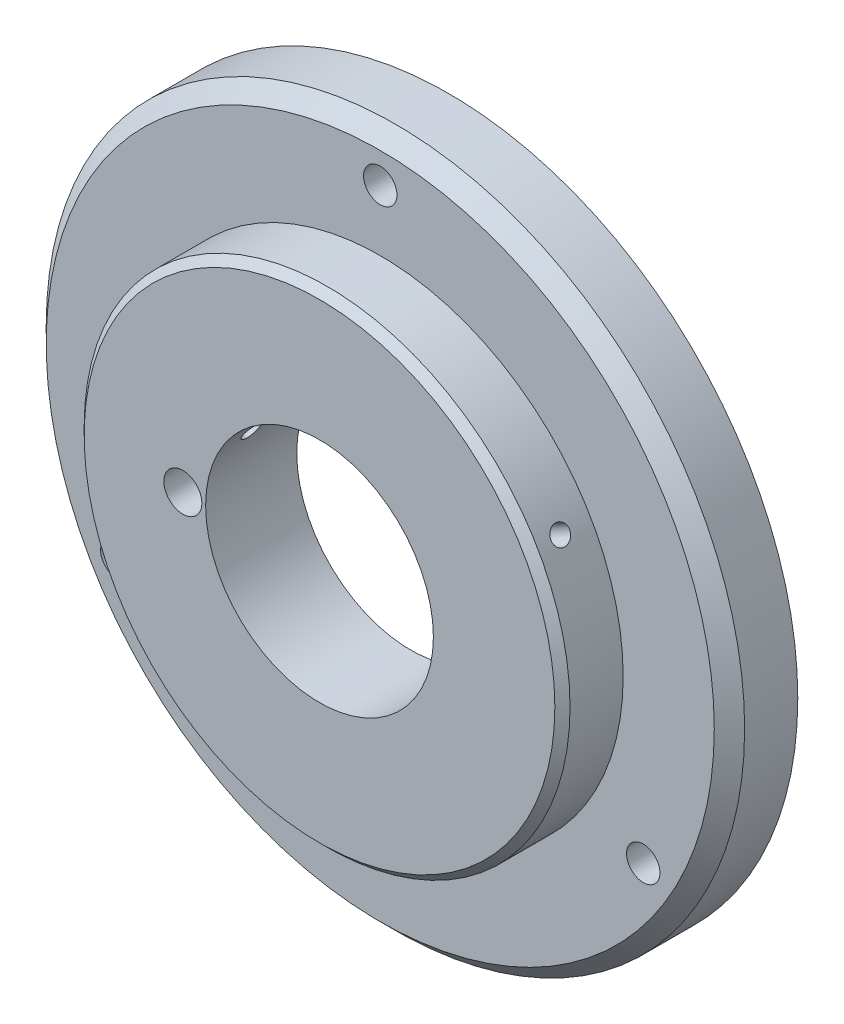
ISO-10303-21;
HEADER;
FILE_DESCRIPTION(('STEP AP214'),'2;1');
FILE_NAME('part.step','',(''),(''),'','','');
FILE_SCHEMA(('AUTOMOTIVE_DESIGN { 1 0 10303 214 1 1 1 1 }'));
ENDSEC;
DATA;
#1=APPLICATION_CONTEXT('core data for automotive mechanical design processes');
#2=APPLICATION_PROTOCOL_DEFINITION('international standard','automotive_design',2000,#1);
#3=PRODUCT_CONTEXT('',#1,'mechanical');
#4=PRODUCT('Part','Part','',(#3));
#5=PRODUCT_RELATED_PRODUCT_CATEGORY('part','',(#4));
#6=PRODUCT_DEFINITION_FORMATION('','',#4);
#7=PRODUCT_DEFINITION_CONTEXT('part definition',#1,'design');
#8=PRODUCT_DEFINITION('design','',#6,#7);
#9=PRODUCT_DEFINITION_SHAPE('','',#8);
#10=(LENGTH_UNIT() NAMED_UNIT(*) SI_UNIT(.MILLI.,.METRE.));
#11=(NAMED_UNIT(*) PLANE_ANGLE_UNIT() SI_UNIT($,.RADIAN.));
#12=(NAMED_UNIT(*) SI_UNIT($,.STERADIAN.) SOLID_ANGLE_UNIT());
#13=UNCERTAINTY_MEASURE_WITH_UNIT(LENGTH_MEASURE(1.E-05),#10,'distance_accuracy_value','');
#14=(GEOMETRIC_REPRESENTATION_CONTEXT(3) GLOBAL_UNCERTAINTY_ASSIGNED_CONTEXT((#13)) GLOBAL_UNIT_ASSIGNED_CONTEXT((#10,
#11,#12)) REPRESENTATION_CONTEXT('',''));
#15=CARTESIAN_POINT('',(0.,0.,0.));
#16=DIRECTION('',(0.,0.,1.));
#17=DIRECTION('',(1.,0.,0.));
#18=AXIS2_PLACEMENT_3D('',#15,#16,#17);
#19=CARTESIAN_POINT('',(0.,0.,9.));
#20=DIRECTION('',(0.,0.,1.));
#21=DIRECTION('',(1.,0.,0.));
#22=AXIS2_PLACEMENT_3D('',#19,#20,#21);
#23=PLANE('',#22);
#24=CARTESIAN_POINT('',(0.,0.,9.));
#25=DIRECTION('',(0.,0.,1.));
#26=DIRECTION('',(1.,0.,0.));
#27=AXIS2_PLACEMENT_3D('',#24,#25,#26);
#28=CIRCLE('',#27,44.);
#29=CARTESIAN_POINT('',(44.,0.,9.));
#30=VERTEX_POINT('',#29);
#31=EDGE_CURVE('E49',#30,#30,#28,.T.);
#32=ORIENTED_EDGE('',*,*,#31,.T.);
#33=EDGE_LOOP('',(#32));
#34=FACE_BOUND('',#33,.T.);
#35=CARTESIAN_POINT('',(-34.6410161513777,-19.9999999999997,9.));
#36=DIRECTION('',(0.,0.,1.));
#37=DIRECTION('',(-0.499999999999992,0.866025403784443,0.));
#38=AXIS2_PLACEMENT_3D('',#35,#36,#37);
#39=CIRCLE('',#38,2.2);
#40=CARTESIAN_POINT('',(-35.7410161513777,-18.0947441116739,9.));
#41=VERTEX_POINT('',#40);
#42=EDGE_CURVE('E83',#41,#41,#39,.T.);
#43=ORIENTED_EDGE('',*,*,#42,.F.);
#44=EDGE_LOOP('',(#43));
#45=FACE_BOUND('',#44,.T.);
#46=CARTESIAN_POINT('',(34.6410161513775,-20.0000000000002,9.));
#47=DIRECTION('',(0.,0.,1.));
#48=DIRECTION('',(-0.500000000000004,-0.866025403784436,0.));
#49=AXIS2_PLACEMENT_3D('',#46,#47,#48);
#50=CIRCLE('',#49,2.2);
#51=CARTESIAN_POINT('',(33.5410161513775,-21.9052558883259,9.));
#52=VERTEX_POINT('',#51);
#53=EDGE_CURVE('E77',#52,#52,#50,.T.);
#54=ORIENTED_EDGE('',*,*,#53,.F.);
#55=EDGE_LOOP('',(#54));
#56=FACE_BOUND('',#55,.T.);
#57=CARTESIAN_POINT('',(0.,40.,9.));
#58=DIRECTION('',(0.,0.,1.));
#59=DIRECTION('',(1.,0.,0.));
#60=AXIS2_PLACEMENT_3D('',#57,#58,#59);
#61=CIRCLE('',#60,2.2);
#62=CARTESIAN_POINT('',(2.2,40.,9.));
#63=VERTEX_POINT('',#62);
#64=EDGE_CURVE('E71',#63,#63,#61,.T.);
#65=ORIENTED_EDGE('',*,*,#64,.F.);
#66=EDGE_LOOP('',(#65));
#67=FACE_BOUND('',#66,.T.);
#68=CARTESIAN_POINT('',(0.,0.,9.));
#69=DIRECTION('',(0.,0.,1.));
#70=DIRECTION('',(1.,0.,0.));
#71=AXIS2_PLACEMENT_3D('',#68,#69,#70);
#72=CIRCLE('',#71,32.);
#73=CARTESIAN_POINT('',(32.,0.,9.));
#74=VERTEX_POINT('',#73);
#75=EDGE_CURVE('E55',#74,#74,#72,.T.);
#76=ORIENTED_EDGE('',*,*,#75,.F.);
#77=EDGE_LOOP('',(#76));
#78=FACE_BOUND('',#77,.T.);
#79=ADVANCED_FACE('F32',(#34,#45,#56,#67,#78),#23,.T.);
#80=CARTESIAN_POINT('',(0.,0.,9.));
#81=DIRECTION('',(0.,0.,-1.));
#82=DIRECTION('',(-1.,0.,0.));
#83=AXIS2_PLACEMENT_3D('',#80,#81,#82);
#84=CYLINDRICAL_SURFACE('',#83,46.);
#85=CARTESIAN_POINT('',(0.,0.,7.));
#86=DIRECTION('',(0.,0.,1.));
#87=DIRECTION('',(1.,0.,0.));
#88=AXIS2_PLACEMENT_3D('',#85,#86,#87);
#89=CIRCLE('',#88,46.);
#90=CARTESIAN_POINT('',(46.,0.,7.));
#91=VERTEX_POINT('',#90);
#92=EDGE_CURVE('E44',#91,#91,#89,.F.);
#93=ORIENTED_EDGE('',*,*,#92,.T.);
#94=EDGE_LOOP('',(#93));
#95=FACE_BOUND('',#94,.T.);
#96=CARTESIAN_POINT('',(0.,0.,0.));
#97=DIRECTION('',(0.,0.,1.));
#98=DIRECTION('',(1.,0.,0.));
#99=AXIS2_PLACEMENT_3D('',#96,#97,#98);
#100=CIRCLE('',#99,46.);
#101=CARTESIAN_POINT('',(46.,0.,0.));
#102=VERTEX_POINT('',#101);
#103=EDGE_CURVE('E52',#102,#102,#100,.T.);
#104=ORIENTED_EDGE('',*,*,#103,.T.);
#105=EDGE_LOOP('',(#104));
#106=FACE_BOUND('',#105,.T.);
#107=ADVANCED_FACE('F140',(#95,#106),#84,.T.);
#108=CARTESIAN_POINT('',(0.,0.,0.));
#109=DIRECTION('',(0.,0.,1.));
#110=DIRECTION('',(1.,0.,0.));
#111=AXIS2_PLACEMENT_3D('',#108,#109,#110);
#112=PLANE('',#111);
#113=CARTESIAN_POINT('',(-34.6410161513777,-19.9999999999997,0.));
#114=DIRECTION('',(0.,0.,1.));
#115=DIRECTION('',(-0.499999999999992,0.866025403784443,0.));
#116=AXIS2_PLACEMENT_3D('',#113,#114,#115);
#117=CIRCLE('',#116,2.2);
#118=CARTESIAN_POINT('',(-35.7410161513777,-18.0947441116739,0.));
#119=VERTEX_POINT('',#118);
#120=EDGE_CURVE('E80',#119,#119,#117,.T.);
#121=ORIENTED_EDGE('',*,*,#120,.T.);
#122=EDGE_LOOP('',(#121));
#123=FACE_BOUND('',#122,.T.);
#124=CARTESIAN_POINT('',(34.6410161513775,-20.0000000000002,0.));
#125=DIRECTION('',(0.,0.,1.));
#126=DIRECTION('',(-0.500000000000004,-0.866025403784436,0.));
#127=AXIS2_PLACEMENT_3D('',#124,#125,#126);
#128=CIRCLE('',#127,2.2);
#129=CARTESIAN_POINT('',(33.5410161513775,-21.9052558883259,0.));
#130=VERTEX_POINT('',#129);
#131=EDGE_CURVE('E74',#130,#130,#128,.T.);
#132=ORIENTED_EDGE('',*,*,#131,.T.);
#133=EDGE_LOOP('',(#132));
#134=FACE_BOUND('',#133,.T.);
#135=CARTESIAN_POINT('',(0.,40.,0.));
#136=DIRECTION('',(0.,0.,1.));
#137=DIRECTION('',(1.,0.,0.));
#138=AXIS2_PLACEMENT_3D('',#135,#136,#137);
#139=CIRCLE('',#138,2.2);
#140=CARTESIAN_POINT('',(2.2,40.,0.));
#141=VERTEX_POINT('',#140);
#142=EDGE_CURVE('E68',#141,#141,#139,.T.);
#143=ORIENTED_EDGE('',*,*,#142,.T.);
#144=EDGE_LOOP('',(#143));
#145=FACE_BOUND('',#144,.T.);
#146=CARTESIAN_POINT('',(0.,0.,0.));
#147=DIRECTION('',(0.,0.,-1.));
#148=DIRECTION('',(-1.,0.,0.));
#149=AXIS2_PLACEMENT_3D('',#146,#147,#148);
#150=CIRCLE('',#149,26.);
#151=CARTESIAN_POINT('',(-26.,0.,0.));
#152=VERTEX_POINT('',#151);
#153=EDGE_CURVE('E59',#152,#152,#150,.T.);
#154=ORIENTED_EDGE('',*,*,#153,.F.);
#155=EDGE_LOOP('',(#154));
#156=FACE_BOUND('',#155,.T.);
#157=ORIENTED_EDGE('',*,*,#103,.F.);
#158=EDGE_LOOP('',(#157));
#159=FACE_BOUND('',#158,.T.);
#160=ADVANCED_FACE('F136',(#123,#134,#145,#156,#159),#112,.F.);
#161=CARTESIAN_POINT('',(0.,0.,17.));
#162=DIRECTION('',(0.,0.,-1.));
#163=DIRECTION('',(-1.,0.,0.));
#164=AXIS2_PLACEMENT_3D('',#161,#162,#163);
#165=CYLINDRICAL_SURFACE('',#164,32.);
#166=CARTESIAN_POINT('',(-28.3049995486143,14.92739094929,13.));
#167=CARTESIAN_POINT('',(-28.3049983013567,14.9273937416056,13.0687817346013));
#168=CARTESIAN_POINT('',(-28.3022875957141,14.9325368080575,13.1376127007864));
#169=CARTESIAN_POINT('',(-28.2914961853581,14.9529720110016,13.2733771365377));
#170=CARTESIAN_POINT('',(-28.2834090969755,14.9682762123288,13.3403082516841));
#171=CARTESIAN_POINT('',(-28.262048613331,15.008568390377,13.4702865713771));
#172=CARTESIAN_POINT('',(-28.2487777929265,15.0335515593219,13.533335686215));
#173=CARTESIAN_POINT('',(-28.217357464949,15.0924433461171,13.6537757279041));
#174=CARTESIAN_POINT('',(-28.1992091343826,15.1263498106193,13.7111680152607));
#175=CARTESIAN_POINT('',(-28.1584451993501,15.2020988472639,13.8187201634661));
#176=CARTESIAN_POINT('',(-28.1358270877819,15.2439458727436,13.8688759379111));
#177=CARTESIAN_POINT('',(-28.0866724815605,15.3343232440568,13.9604966941986));
#178=CARTESIAN_POINT('',(-28.0601358295691,15.3828538582462,14.0019613269103));
#179=CARTESIAN_POINT('',(-28.0037946901089,15.4851829222492,14.0750318070124));
#180=CARTESIAN_POINT('',(-27.9739892617414,15.5389828883366,14.1066348056686));
#181=CARTESIAN_POINT('',(-27.9118830791877,15.6502664244368,14.1590665405304));
#182=CARTESIAN_POINT('',(-27.8795823381416,15.7077499750518,14.1798953334679));
#183=CARTESIAN_POINT('',(-27.8133632815626,15.8247064501016,14.2101775270137));
#184=CARTESIAN_POINT('',(-27.779445773912,15.8841783766191,14.2196365483016));
#185=CARTESIAN_POINT('',(-27.7109156913184,16.0034333943823,14.2269280231671));
#186=CARTESIAN_POINT('',(-27.6763031201031,16.063216483958,14.2247605390816));
#187=CARTESIAN_POINT('',(-27.6073907342089,16.1813674616062,14.2088652324668));
#188=CARTESIAN_POINT('',(-27.573090765164,16.2397360747586,14.1951434675457));
#189=CARTESIAN_POINT('',(-27.5057961475346,16.3534567185034,14.1565384898046));
#190=CARTESIAN_POINT('',(-27.4728015027454,16.4088087403255,14.1316552445362));
#191=CARTESIAN_POINT('',(-27.4091096027486,16.5149795200087,14.071426713911));
#192=CARTESIAN_POINT('',(-27.3784129586265,16.5657970727463,14.0360786580408));
#193=CARTESIAN_POINT('',(-27.3202815967972,16.6614931257471,13.9559259482309));
#194=CARTESIAN_POINT('',(-27.2928468920548,16.7063716024053,13.9111212567074));
#195=CARTESIAN_POINT('',(-27.2420959965874,16.7890012741705,13.8132928451493));
#196=CARTESIAN_POINT('',(-27.2187824597205,16.8267478777217,13.7602638699825));
#197=CARTESIAN_POINT('',(-27.1770530379904,16.8940629148845,13.6475106960367));
#198=CARTESIAN_POINT('',(-27.1586371540793,16.9236313469063,13.5877864959562));
#199=CARTESIAN_POINT('',(-27.1273112044258,16.9737993937542,13.4633351612558));
#200=CARTESIAN_POINT('',(-27.1144012337773,16.9943988536751,13.3986079402503));
#201=CARTESIAN_POINT('',(-27.0945198283844,17.0260784693013,13.2659893169949));
#202=CARTESIAN_POINT('',(-27.0875483674093,17.0371586670534,13.1980979287225));
#203=CARTESIAN_POINT('',(-27.0797817491522,17.0495007181364,13.0611243202513));
#204=CARTESIAN_POINT('',(-27.0789826742475,17.0507687992333,12.9920428832917));
#205=CARTESIAN_POINT('',(-27.0835775327228,17.0434693039088,12.8546095938781));
#206=CARTESIAN_POINT('',(-27.0889714542317,17.0349017463408,12.7862577400258));
#207=CARTESIAN_POINT('',(-27.1057676239354,17.0081629842464,12.6522444390824));
#208=CARTESIAN_POINT('',(-27.1171680943727,16.9899946212646,12.5865822021398));
#209=CARTESIAN_POINT('',(-27.1455943400434,16.9445396026231,12.4597877638274));
#210=CARTESIAN_POINT('',(-27.1626201341274,16.9172529164078,12.3986555776388));
#211=CARTESIAN_POINT('',(-27.2017433322741,16.8542733281679,12.2826227072665));
#212=CARTESIAN_POINT('',(-27.2238432924148,16.8185761891949,12.2277251846564));
#213=CARTESIAN_POINT('',(-27.2723893093669,16.7397406967326,12.1257517540582));
#214=CARTESIAN_POINT('',(-27.2988353831568,16.6966023141732,12.0786758766278));
#215=CARTESIAN_POINT('',(-27.3552419692377,16.6040257392653,11.9936574483767));
#216=CARTESIAN_POINT('',(-27.3852042948371,16.5545842953243,11.9557196410543));
#217=CARTESIAN_POINT('',(-27.4476930805627,16.4507692919427,11.8900866901772));
#218=CARTESIAN_POINT('',(-27.4802195329994,16.3963957472929,11.8623915159073));
#219=CARTESIAN_POINT('',(-27.5468324212783,16.2842338859241,11.8180383124666));
#220=CARTESIAN_POINT('',(-27.5809184219398,16.2264465205122,11.801377224154));
#221=CARTESIAN_POINT('',(-27.6496448163369,16.1090584915163,11.7795551141235));
#222=CARTESIAN_POINT('',(-27.6842852086535,16.0494578325732,11.7743940629749));
#223=CARTESIAN_POINT('',(-27.7530989114255,15.9301675861921,11.775718874063));
#224=CARTESIAN_POINT('',(-27.7872725068437,15.8704780801664,11.7821972783576));
#225=CARTESIAN_POINT('',(-27.8542233522955,15.7526770210819,11.8066017284926));
#226=CARTESIAN_POINT('',(-27.8870005996042,15.6945654711025,11.8245277966713));
#227=CARTESIAN_POINT('',(-27.9502782413008,15.5815962442221,11.8713174142083));
#228=CARTESIAN_POINT('',(-27.9807786032152,15.5267386137314,11.9001811195264));
#229=CARTESIAN_POINT('',(-28.0387109921327,15.4218766295864,11.9680248713286));
#230=CARTESIAN_POINT('',(-28.0661431241071,15.3718721099036,12.0070045715696));
#231=CARTESIAN_POINT('',(-28.117268497975,15.2781565770395,12.093998653145));
#232=CARTESIAN_POINT('',(-28.1409597373999,15.234448935614,12.1420178432989));
#233=CARTESIAN_POINT('',(-28.1840175462792,15.154643416685,12.2457319580333));
#234=CARTESIAN_POINT('',(-28.2033830458871,15.1185474218251,12.301428775957));
#235=CARTESIAN_POINT('',(-28.2373381026415,15.0550336755756,12.4189466360042));
#236=CARTESIAN_POINT('',(-28.251924031238,15.0276225180524,12.480772284843));
#237=CARTESIAN_POINT('',(-28.27595039224,14.9823660388844,12.6087129367533));
#238=CARTESIAN_POINT('',(-28.2853969401694,14.9645093484738,12.6748227366231));
#239=CARTESIAN_POINT('',(-28.2964381247257,14.9436162500752,12.7844564585058));
#240=CARTESIAN_POINT('',(-28.2996453017304,14.9375398639545,12.827269277635));
#241=CARTESIAN_POINT('',(-28.3039264059179,14.9294263352423,12.9133815553891));
#242=CARTESIAN_POINT('',(-28.3050003341416,14.9273891906795,12.9566810137763));
#243=CARTESIAN_POINT('',(-28.3049995486143,14.92739094929,13.));
#244=B_SPLINE_CURVE_WITH_KNOTS('',3,(#166,#167,#168,#169,#170,#171,#172,#173,#174,#175,#176,
#177,#178,#179,#180,#181,#182,#183,#184,#185,#186,#187,#188,#189,#190,#191,#192,#193,#194,#195,
#196,#197,#198,#199,#200,#201,#202,#203,#204,#205,#206,#207,#208,#209,#210,#211,#212,#213,#214,
#215,#216,#217,#218,#219,#220,#221,#222,#223,#224,#225,#226,#227,#228,#229,#230,#231,#232,#233,
#234,#235,#236,#237,#238,#239,#240,#241,#242,#243),.UNSPECIFIED.,.T.,.F.,(4,2,2,2,2,2,2,2,2,2,2,
2,2,2,2,2,2,2,2,2,2,2,2,2,2,2,2,2,2,2,2,2,2,2,2,2,2,2,4),(0.,0.206187080004386,
0.412619415335633,0.618949341960605,0.825229523130307,1.03162573703227,1.23803024046186,
1.44449431296398,1.65095729831371,1.85731817605756,2.06367794737312,2.26992959695209,
2.47618184614542,2.68248874863491,2.88879647106754,3.09523656678553,3.30167670263388,
3.50812040381157,3.71456319311665,3.92087494209924,4.12718629561428,4.33343662145748,
4.53968763845891,4.74604278190158,4.95239873151231,5.15886156909222,5.3653237875384,
5.57172874144185,5.77813316711757,5.98440538701568,6.1906780094248,6.3969535731837,
6.60322207761985,6.80960062427798,7.01603015631957,7.22261604419479,7.42895556782024,
7.5588130029242,7.68867037465197),.UNSPECIFIED.);
#245=CARTESIAN_POINT('',(-28.3049995486143,14.92739094929,13.));
#246=VERTEX_POINT('',#245);
#247=EDGE_CURVE('E202',#246,#246,#244,.T.);
#248=ORIENTED_EDGE('',*,*,#247,.F.);
#249=EDGE_LOOP('',(#248));
#250=FACE_BOUND('',#249,.T.);
#251=CARTESIAN_POINT('',(27.0799995486143,17.0491531885619,13.));
#252=CARTESIAN_POINT('',(27.0800013432017,17.0491507122473,13.0687817346013));
#253=CARTESIAN_POINT('',(27.0831000165812,17.0442316390727,13.1376127007864));
#254=CARTESIAN_POINT('',(27.0954017162842,17.0246684020897,13.2733771365377));
#255=CARTESIAN_POINT('',(27.1046119992269,17.0100126774442,13.3403082516841));
#256=CARTESIAN_POINT('',(27.1288258071681,16.9713678669468,13.4702865713771));
#257=CARTESIAN_POINT('',(27.1438264559392,16.947383414875,13.533335686215));
#258=CARTESIAN_POINT('',(27.1791180753894,16.8907267192536,13.6537757279041));
#259=CARTESIAN_POINT('',(27.1994077697177,16.8580565716957,13.7111680152607));
#260=CARTESIAN_POINT('',(27.2446263922478,16.7848794500771,13.8187201634661));
#261=CARTESIAN_POINT('',(27.2695579236019,16.7443680781335,13.8688759379111));
#262=CARTESIAN_POINT('',(27.3232497199757,16.6566102547762,13.9604966941986));
#263=CARTESIAN_POINT('',(27.3520101387293,16.6093635329255,14.0019613269103));
#264=CARTESIAN_POINT('',(27.4124591379712,16.5094061428733,14.0750318070124));
#265=CARTESIAN_POINT('',(27.444148561142,16.4566939016928,14.1066348056686));
#266=CARTESIAN_POINT('',(27.5094698391508,16.3472666018191,14.1590665405304));
#267=CARTESIAN_POINT('',(27.5431016837601,16.2905515642046,14.1798953334679));
#268=CARTESIAN_POINT('',(27.6112794340008,16.1747259414676,14.2101775270137));
#269=CARTESIAN_POINT('',(27.6458248793517,16.1156165549504,14.2196365483016));
#270=CARTESIAN_POINT('',(27.7148377129666,15.9966402536192,14.2269280231671));
#271=CARTESIAN_POINT('',(27.7493051016482,15.9367733428686,14.2247605390816));
#272=CARTESIAN_POINT('',(27.8171706568264,15.8180179772248,14.2088652324668));
#273=CARTESIAN_POINT('',(27.8505693740776,15.7591290261067,14.1951434675457));
#274=CARTESIAN_POINT('',(27.9154070316806,15.6439898558293,14.1565384898046));
#275=CARTESIAN_POINT('',(27.9468459663348,15.587739644342,14.1316552445362));
#276=CARTESIAN_POINT('',(28.0069466086816,15.4794954510878,14.071426713911));
#277=CARTESIAN_POINT('',(28.0356075782495,15.4275026010983,14.0360786580408));
#278=CARTESIAN_POINT('',(28.0894171102754,15.3293113384972,13.9559259482309));
#279=CARTESIAN_POINT('',(28.1145656587734,15.2831129489158,13.9111212567074));
#280=CARTESIAN_POINT('',(28.1607496058948,15.1978465482937,13.8132928451493));
#281=CARTESIAN_POINT('',(28.1817823550432,15.1587831313393,13.7602638699825));
#282=CARTESIAN_POINT('',(28.2192141764178,15.0889868734544,13.6475106960367));
#283=CARTESIAN_POINT('',(28.2356132477433,15.0582540341433,13.5877864959562));
#284=CARTESIAN_POINT('',(28.263397075945,15.0060409425218,13.4633351612558));
#285=CARTESIAN_POINT('',(28.2747817462165,14.9845608500176,13.3986079402503));
#286=CARTESIAN_POINT('',(28.2922763954345,14.9515032400712,13.2659893169949));
#287=CARTESIAN_POINT('',(28.2983863976792,14.9399256788893,13.1980979287225));
#288=CARTESIAN_POINT('',(28.3051916183234,14.9270285646357,13.0611243202513));
#289=CARTESIAN_POINT('',(28.305890271315,14.9257025049202,12.9920428832917));
#290=CARTESIAN_POINT('',(28.3018661521667,14.9333315167489,12.8546095938781));
#291=CARTESIAN_POINT('',(28.2971433904189,14.9422865685856,12.7862577400258));
#292=CARTESIAN_POINT('',(28.2823850280314,14.9702018592825,12.6522444390824));
#293=CARTESIAN_POINT('',(28.2723509993625,14.9891591377872,12.5865822021398));
#294=CARTESIAN_POINT('',(28.2471989213249,15.0365044979929,12.4597877638274));
#295=CARTESIAN_POINT('',(28.2320808549193,15.0648926112969,12.3986555776388));
#296=CARTESIAN_POINT('',(28.1971005306571,15.1302640888893,12.2826227072665));
#297=CARTESIAN_POINT('',(28.1772358815344,15.1672517852802,12.2277251846564));
#298=CARTESIAN_POINT('',(28.1332353508181,15.2487116154444,12.1257517540582));
#299=CARTESIAN_POINT('',(28.1090994525385,15.2931837784566,12.0786758766279));
#300=CARTESIAN_POINT('',(28.0571290799134,15.3883216023973,11.9936574483767));
#301=CARTESIAN_POINT('',(28.0292926962604,15.4389904594934,11.9557196410543));
#302=CARTESIAN_POINT('',(27.9706306589008,15.5450148370742,11.8900866901772));
#303=CARTESIAN_POINT('',(27.9398050141586,15.6003703435043,11.8623915159073));
#304=CARTESIAN_POINT('',(27.8759764370168,15.7141397276576,11.8180383124666));
#305=CARTESIAN_POINT('',(27.8429741108831,15.7725527528499,11.801377224154));
#306=CARTESIAN_POINT('',(27.7756762928711,15.8907655708062,11.7795551141235));
#307=CARTESIAN_POINT('',(27.7413808043023,15.9505653600209,11.7743940629749));
#308=CARTESIAN_POINT('',(27.6724792718986,16.0698048979405,11.775718874063));
#309=CARTESIAN_POINT('',(27.6378734410501,16.1292448527242,11.7821972783576));
#310=CARTESIAN_POINT('',(27.5693301540161,16.2461265152325,11.8066017284926));
#311=CARTESIAN_POINT('',(27.5353926991351,16.3035682190577,11.8245277966713));
#312=CARTESIAN_POINT('',(27.469197299659,16.4148528776987,11.8713174142083));
#313=CARTESIAN_POINT('',(27.4369393790199,16.4686957811865,11.9001811195264));
#314=CARTESIAN_POINT('',(27.3750924313178,16.5712976937636,11.9680248713286));
#315=CARTESIAN_POINT('',(27.3455033129556,16.6200568767748,12.0070045715696));
#316=CARTESIAN_POINT('',(27.2899059677001,16.7111905157544,12.093998653145));
#317=CARTESIAN_POINT('',(27.2638996595986,16.7535615516563,12.1420178432989));
#318=CARTESIAN_POINT('',(27.2163149572835,16.8307534674415,12.2457319580333));
#319=CARTESIAN_POINT('',(27.1947376585639,16.8655724794888,12.301428775957));
#320=CARTESIAN_POINT('',(27.1567106691995,16.9267352943499,12.4189466360042));
#321=CARTESIAN_POINT('',(27.1402648747356,16.9530726578138,12.480772284843));
#322=CARTESIAN_POINT('',(27.1130847945912,16.9965083363861,12.6087129367533));
#323=CARTESIAN_POINT('',(27.1023437210328,17.0136176320763,12.6748227366231));
#324=CARTESIAN_POINT('',(27.089770359334,17.0336261275892,12.7844564585058));
#325=CARTESIAN_POINT('',(27.0861116430926,17.0394418174101,12.827269277635));
#326=CARTESIAN_POINT('',(27.0812256732073,17.0472061267488,12.9133815553891));
#327=CARTESIAN_POINT('',(27.0799984183766,17.0491547481538,12.9566810137763));
#328=CARTESIAN_POINT('',(27.0799995486143,17.0491531885619,13.));
#329=B_SPLINE_CURVE_WITH_KNOTS('',3,(#251,#252,#253,#254,#255,#256,#257,#258,#259,#260,#261,
#262,#263,#264,#265,#266,#267,#268,#269,#270,#271,#272,#273,#274,#275,#276,#277,#278,#279,#280,
#281,#282,#283,#284,#285,#286,#287,#288,#289,#290,#291,#292,#293,#294,#295,#296,#297,#298,#299,
#300,#301,#302,#303,#304,#305,#306,#307,#308,#309,#310,#311,#312,#313,#314,#315,#316,#317,#318,
#319,#320,#321,#322,#323,#324,#325,#326,#327,#328),.UNSPECIFIED.,.T.,.F.,(4,2,2,2,2,2,2,2,2,2,2,
2,2,2,2,2,2,2,2,2,2,2,2,2,2,2,2,2,2,2,2,2,2,2,2,2,2,2,4),(0.,0.206187080004389,
0.412619415335631,0.618949341960605,0.825229523130309,1.03162573703227,1.23803024046186,
1.44449431296398,1.65095729831372,1.85731817605757,2.06367794737312,2.26992959695208,
2.47618184614542,2.68248874863491,2.88879647106755,3.09523656678552,3.30167670263387,
3.50812040381157,3.71456319311664,3.92087494209924,4.12718629561427,4.33343662145747,
4.5396876384589,4.74604278190158,4.95239873151231,5.15886156909222,5.36532378753841,
5.57172874144186,5.77813316711757,5.98440538701568,6.19067800942481,6.39695357318371,
6.60322207761986,6.80960062427799,7.01603015631957,7.22261604419479,7.42895556782025,
7.55881300292421,7.68867037465198),.UNSPECIFIED.);
#330=CARTESIAN_POINT('',(27.0799995486143,17.0491531885619,13.));
#331=VERTEX_POINT('',#330);
#332=EDGE_CURVE('E86',#331,#331,#329,.T.);
#333=ORIENTED_EDGE('',*,*,#332,.F.);
#334=EDGE_LOOP('',(#333));
#335=FACE_BOUND('',#334,.T.);
#336=CARTESIAN_POINT('',(0.,0.,16.));
#337=DIRECTION('',(0.,0.,1.));
#338=DIRECTION('',(1.,0.,0.));
#339=AXIS2_PLACEMENT_3D('',#336,#337,#338);
#340=CIRCLE('',#339,32.);
#341=CARTESIAN_POINT('',(32.,0.,16.));
#342=VERTEX_POINT('',#341);
#343=EDGE_CURVE('E10',#342,#342,#340,.F.);
#344=ORIENTED_EDGE('',*,*,#343,.T.);
#345=EDGE_LOOP('',(#344));
#346=FACE_BOUND('',#345,.T.);
#347=ORIENTED_EDGE('',*,*,#75,.T.);
#348=EDGE_LOOP('',(#347));
#349=FACE_BOUND('',#348,.T.);
#350=ADVANCED_FACE('F132',(#250,#335,#346,#349),#165,.T.);
#351=CARTESIAN_POINT('',(0.,0.,17.));
#352=DIRECTION('',(0.,0.,1.));
#353=DIRECTION('',(1.,0.,0.));
#354=AXIS2_PLACEMENT_3D('',#351,#352,#353);
#355=PLANE('',#354);
#356=CARTESIAN_POINT('',(-18.,0.,17.));
#357=DIRECTION('',(0.,0.,1.));
#358=DIRECTION('',(1.,0.,0.));
#359=AXIS2_PLACEMENT_3D('',#356,#357,#358);
#360=CIRCLE('',#359,2.5);
#361=CARTESIAN_POINT('',(-15.5,0.,17.));
#362=VERTEX_POINT('',#361);
#363=EDGE_CURVE('E231',#362,#362,#360,.T.);
#364=ORIENTED_EDGE('',*,*,#363,.F.);
#365=EDGE_LOOP('',(#364));
#366=FACE_BOUND('',#365,.T.);
#367=CARTESIAN_POINT('',(0.,0.,17.));
#368=DIRECTION('',(0.,0.,1.));
#369=DIRECTION('',(1.,0.,0.));
#370=AXIS2_PLACEMENT_3D('',#367,#368,#369);
#371=CIRCLE('',#370,31.);
#372=CARTESIAN_POINT('',(31.,0.,17.));
#373=VERTEX_POINT('',#372);
#374=EDGE_CURVE('E40',#373,#373,#371,.T.);
#375=ORIENTED_EDGE('',*,*,#374,.T.);
#376=EDGE_LOOP('',(#375));
#377=FACE_BOUND('',#376,.T.);
#378=CARTESIAN_POINT('',(0.,0.,17.));
#379=DIRECTION('',(0.,0.,-1.));
#380=DIRECTION('',(-1.,0.,0.));
#381=AXIS2_PLACEMENT_3D('',#378,#379,#380);
#382=CIRCLE('',#381,15.);
#383=CARTESIAN_POINT('',(-15.,0.,17.));
#384=VERTEX_POINT('',#383);
#385=EDGE_CURVE('E62',#384,#384,#382,.T.);
#386=ORIENTED_EDGE('',*,*,#385,.T.);
#387=EDGE_LOOP('',(#386));
#388=FACE_BOUND('',#387,.T.);
#389=ADVANCED_FACE('F128',(#366,#377,#388),#355,.T.);
#390=CARTESIAN_POINT('',(0.,0.,5.));
#391=DIRECTION('',(0.,0.,-1.));
#392=DIRECTION('',(-1.,0.,0.));
#393=AXIS2_PLACEMENT_3D('',#390,#391,#392);
#394=CYLINDRICAL_SURFACE('',#393,26.);
#395=CARTESIAN_POINT('',(0.,0.,5.));
#396=DIRECTION('',(0.,0.,-1.));
#397=DIRECTION('',(-1.,0.,0.));
#398=AXIS2_PLACEMENT_3D('',#395,#396,#397);
#399=CIRCLE('',#398,26.);
#400=CARTESIAN_POINT('',(-26.,0.,5.));
#401=VERTEX_POINT('',#400);
#402=EDGE_CURVE('E58',#401,#401,#399,.T.);
#403=ORIENTED_EDGE('',*,*,#402,.F.);
#404=EDGE_LOOP('',(#403));
#405=FACE_BOUND('',#404,.T.);
#406=ORIENTED_EDGE('',*,*,#153,.T.);
#407=EDGE_LOOP('',(#406));
#408=FACE_BOUND('',#407,.T.);
#409=ADVANCED_FACE('F124',(#405,#408),#394,.F.);
#410=CARTESIAN_POINT('',(0.,0.,5.));
#411=DIRECTION('',(0.,0.,-1.));
#412=DIRECTION('',(-1.,0.,0.));
#413=AXIS2_PLACEMENT_3D('',#410,#411,#412);
#414=PLANE('',#413);
#415=CARTESIAN_POINT('',(-18.,0.,5.));
#416=DIRECTION('',(0.,0.,-1.));
#417=DIRECTION('',(-1.,0.,0.));
#418=AXIS2_PLACEMENT_3D('',#415,#416,#417);
#419=CIRCLE('',#418,2.5);
#420=CARTESIAN_POINT('',(-20.5,0.,5.));
#421=VERTEX_POINT('',#420);
#422=EDGE_CURVE('E36',#421,#421,#419,.T.);
#423=ORIENTED_EDGE('',*,*,#422,.F.);
#424=EDGE_LOOP('',(#423));
#425=FACE_BOUND('',#424,.T.);
#426=CARTESIAN_POINT('',(0.,0.,5.));
#427=DIRECTION('',(0.,0.,-1.));
#428=DIRECTION('',(-1.,0.,0.));
#429=AXIS2_PLACEMENT_3D('',#426,#427,#428);
#430=CIRCLE('',#429,15.);
#431=CARTESIAN_POINT('',(-15.,0.,5.));
#432=VERTEX_POINT('',#431);
#433=EDGE_CURVE('E65',#432,#432,#430,.T.);
#434=ORIENTED_EDGE('',*,*,#433,.F.);
#435=EDGE_LOOP('',(#434));
#436=FACE_BOUND('',#435,.T.);
#437=ORIENTED_EDGE('',*,*,#402,.T.);
#438=EDGE_LOOP('',(#437));
#439=FACE_BOUND('',#438,.T.);
#440=ADVANCED_FACE('F120',(#425,#436,#439),#414,.T.);
#441=CARTESIAN_POINT('',(0.,0.,17.));
#442=DIRECTION('',(0.,0.,-1.));
#443=DIRECTION('',(-1.,0.,0.));
#444=AXIS2_PLACEMENT_3D('',#441,#442,#443);
#445=CYLINDRICAL_SURFACE('',#444,15.);
#446=CARTESIAN_POINT('',(-13.5594892735725,6.41406662265628,13.));
#447=CARTESIAN_POINT('',(-13.559488347698,6.41406955516327,12.9313144216267));
#448=CARTESIAN_POINT('',(-13.5570055119086,6.41932551894691,12.8625819624061));
#449=CARTESIAN_POINT('',(-13.5471033190011,6.44019564306344,12.7270184306726));
#450=CARTESIAN_POINT('',(-13.5396783545706,6.4558215690394,12.6601896079307));
#451=CARTESIAN_POINT('',(-13.5200062530891,6.4969182545386,12.5304164069569));
#452=CARTESIAN_POINT('',(-13.5077618327377,6.52238346756376,12.4674698633889));
#453=CARTESIAN_POINT('',(-13.4786479928455,6.58233647330402,12.3472147010565));
#454=CARTESIAN_POINT('',(-13.4617795683873,6.61682232471085,12.2899048728763));
#455=CARTESIAN_POINT('',(-13.4236594093565,6.69381894304783,12.1823932360871));
#456=CARTESIAN_POINT('',(-13.4023981551934,6.73634712105274,12.1322072706873));
#457=CARTESIAN_POINT('',(-13.3559050229508,6.82806259814478,12.0405040264282));
#458=CARTESIAN_POINT('',(-13.3306729722019,6.87725018680195,11.998987124724));
#459=CARTESIAN_POINT('',(-13.2767110099942,6.98085637997165,11.9257480785857));
#460=CARTESIAN_POINT('',(-13.2479762942031,7.03528214726932,11.8940396032232));
#461=CARTESIAN_POINT('',(-13.1876804793944,7.14766715637119,11.8414049351163));
#462=CARTESIAN_POINT('',(-13.1561194281151,7.20562633848896,11.8204785602973));
#463=CARTESIAN_POINT('',(-13.0910225282056,7.32322561747348,11.7900476145663));
#464=CARTESIAN_POINT('',(-13.0574912805236,7.38286164081161,11.7805174618995));
#465=CARTESIAN_POINT('',(-12.9892888800799,7.50220615430603,11.7730704118476));
#466=CARTESIAN_POINT('',(-12.9546177477728,7.56191464314347,11.7751533061848));
#467=CARTESIAN_POINT('',(-12.8852204214565,7.67956702390573,11.7908522874746));
#468=CARTESIAN_POINT('',(-12.8504945558231,7.73751478366041,11.8044408644831));
#469=CARTESIAN_POINT('',(-12.7819681484882,7.85020011342145,11.842722713393));
#470=CARTESIAN_POINT('',(-12.7481676152978,7.90493765390616,11.8674160873976));
#471=CARTESIAN_POINT('',(-12.6825428995629,8.00980276889789,11.9272372809871));
#472=CARTESIAN_POINT('',(-12.650721107174,8.05992480208001,11.9623774343303));
#473=CARTESIAN_POINT('',(-12.5901715853768,8.15418436510812,12.0420857300478));
#474=CARTESIAN_POINT('',(-12.5614439162205,8.19832177841972,12.0866540559672));
#475=CARTESIAN_POINT('',(-12.508013775381,8.27961168126041,12.1841086426748));
#476=CARTESIAN_POINT('',(-12.4833232988846,8.3167434042367,12.2370188054194));
#477=CARTESIAN_POINT('',(-12.4389738774208,8.38293034887679,12.3495718028442));
#478=CARTESIAN_POINT('',(-12.4193149363666,8.4119855642591,12.4092146427606));
#479=CARTESIAN_POINT('',(-12.3857702024778,8.46129957099988,12.5335566478646));
#480=CARTESIAN_POINT('',(-12.3718850820036,8.48155733790925,12.5982564008873));
#481=CARTESIAN_POINT('',(-12.3504314163139,8.51276721366739,12.7308677048156));
#482=CARTESIAN_POINT('',(-12.3428627436295,8.52371951030494,12.7987791908778));
#483=CARTESIAN_POINT('',(-12.3343535143276,8.53602837036123,12.9356764099025));
#484=CARTESIAN_POINT('',(-12.3333938939844,8.5374125329808,13.0046584773945));
#485=CARTESIAN_POINT('',(-12.3380902450599,8.5306239793174,13.1419230288621));
#486=CARTESIAN_POINT('',(-12.3437461572523,8.5224513485925,13.2102055190954));
#487=CARTESIAN_POINT('',(-12.3614376880891,8.49676987847431,13.3440367747194));
#488=CARTESIAN_POINT('',(-12.3734644889309,8.47927394305652,13.4095891838217));
#489=CARTESIAN_POINT('',(-12.4034259030438,8.43538545375059,13.5362123185452));
#490=CARTESIAN_POINT('',(-12.4213606074163,8.40899276267201,13.5972829750389));
#491=CARTESIAN_POINT('',(-12.4625062670742,8.34789147504562,13.7133620794016));
#492=CARTESIAN_POINT('',(-12.4857291701809,8.3131640377609,13.7683563742924));
#493=CARTESIAN_POINT('',(-12.5365725951547,8.23628955949791,13.8705786699512));
#494=CARTESIAN_POINT('',(-12.5641931897243,8.19414239585593,13.9178065422989));
#495=CARTESIAN_POINT('',(-12.6229193504403,8.10338385443607,14.0032693793248));
#496=CARTESIAN_POINT('',(-12.6540330704143,8.05475730059015,14.0414826292478));
#497=CARTESIAN_POINT('',(-12.7186206491787,7.95237995837388,14.1076825312718));
#498=CARTESIAN_POINT('',(-12.7520944851847,7.89862921947008,14.1356692820821));
#499=CARTESIAN_POINT('',(-12.8202566977986,7.78750653759673,14.1805844090159));
#500=CARTESIAN_POINT('',(-12.8549435420304,7.73013909485493,14.1975262416018));
#501=CARTESIAN_POINT('',(-12.9244834222222,7.61330072140068,14.2199146010079));
#502=CARTESIAN_POINT('',(-12.959336455162,7.55382982879015,14.2253613359422));
#503=CARTESIAN_POINT('',(-13.0280796124283,7.43463927809407,14.2246025011091));
#504=CARTESIAN_POINT('',(-13.0619722431455,7.37492084710326,14.2184307852541));
#505=CARTESIAN_POINT('',(-13.127974174312,7.25678126341386,14.1946808018539));
#506=CARTESIAN_POINT('',(-13.1600834722619,7.19836011253354,14.1771025183222));
#507=CARTESIAN_POINT('',(-13.2217103570306,7.08453015338715,14.1310469096928));
#508=CARTESIAN_POINT('',(-13.2512280795151,7.02912118749487,14.1025701555352));
#509=CARTESIAN_POINT('',(-13.3069986630181,6.92296081822583,14.0355298835521));
#510=CARTESIAN_POINT('',(-13.333251578619,6.87220933698692,13.9969665343922));
#511=CARTESIAN_POINT('',(-13.3820177579515,6.77676074600151,13.910720737681));
#512=CARTESIAN_POINT('',(-13.404520435716,6.73208083817772,13.8630132672248));
#513=CARTESIAN_POINT('',(-13.4452769218401,6.65030989971168,13.7598780534208));
#514=CARTESIAN_POINT('',(-13.4635296989525,6.61322071123682,13.704448441484));
#515=CARTESIAN_POINT('',(-13.495491432514,6.54775112421475,13.5873388720746));
#516=CARTESIAN_POINT('',(-13.50919208118,6.51938665549063,13.5256477520091));
#517=CARTESIAN_POINT('',(-13.531769760483,6.47239469665562,13.3978898600362));
#518=CARTESIAN_POINT('',(-13.5406523465979,6.45375599317606,13.3318282266388));
#519=CARTESIAN_POINT('',(-13.5511982514045,6.43157155261463,13.2211462586354));
#520=CARTESIAN_POINT('',(-13.5543049261581,6.42501686908441,13.1772381202505));
#521=CARTESIAN_POINT('',(-13.5584507342278,6.41626346065912,13.0888932002174));
#522=CARTESIAN_POINT('',(-13.5594898728404,6.41406472460482,13.0444564199238));
#523=CARTESIAN_POINT('',(-13.5594892735725,6.41406662265628,13.));
#524=B_SPLINE_CURVE_WITH_KNOTS('',3,(#446,#447,#448,#449,#450,#451,#452,#453,#454,#455,#456,
#457,#458,#459,#460,#461,#462,#463,#464,#465,#466,#467,#468,#469,#470,#471,#472,#473,#474,#475,
#476,#477,#478,#479,#480,#481,#482,#483,#484,#485,#486,#487,#488,#489,#490,#491,#492,#493,#494,
#495,#496,#497,#498,#499,#500,#501,#502,#503,#504,#505,#506,#507,#508,#509,#510,#511,#512,#513,
#514,#515,#516,#517,#518,#519,#520,#521,#522,#523),.UNSPECIFIED.,.T.,.F.,(4,2,2,2,2,2,2,2,2,2,2,
2,2,2,2,2,2,2,2,2,2,2,2,2,2,2,2,2,2,2,2,2,2,2,2,2,2,2,4),(0.,0.205894418663939,
0.412022843129906,0.61803524020284,0.824003338304828,1.03042255643546,1.23685075314323,
1.44356534646247,1.65027644892585,1.85652265878516,2.06276516967306,2.26851594526201,
2.47426861266825,2.68026516867356,2.8862657353328,3.09286765987674,3.29946974510441,
3.50609588237432,3.71271784973207,3.91874356816173,4.12476744214092,4.330506905353,
4.53624954126972,4.74246171404553,4.94867729626287,5.15538465851986,5.36209002552027,
5.56854308217908,5.77499240105822,5.98084109758255,6.18669008260688,6.39252828526155,
6.59836304615927,6.80476933064397,7.01122564796493,7.21805671126558,7.42464877781758,
7.55791332042347,7.69117752162669),.UNSPECIFIED.);
#525=CARTESIAN_POINT('',(-13.5594892735725,6.41406662265628,13.));
#526=VERTEX_POINT('',#525);
#527=EDGE_CURVE('E204',#526,#526,#524,.T.);
#528=ORIENTED_EDGE('',*,*,#527,.F.);
#529=EDGE_LOOP('',(#528));
#530=FACE_BOUND('',#529,.T.);
#531=CARTESIAN_POINT('',(12.3344892735725,8.53582886192815,13.));
#532=CARTESIAN_POINT('',(12.3344913502608,8.53582659384384,12.9313144216267));
#533=CARTESIAN_POINT('',(12.3378017305241,8.53104841308498,12.8625819624061));
#534=CARTESIAN_POINT('',(12.3509246917354,8.51203780041564,12.7270184306726));
#535=CARTESIAN_POINT('',(12.360744658373,8.49779462960871,12.6601896079306));
#536=CARTESIAN_POINT('',(12.3864993812858,8.46020974723023,12.5304164069569));
#537=CARTESIAN_POINT('',(12.4024306925027,8.43687316163874,12.4674698633889));
#538=CARTESIAN_POINT('',(12.439794598561,8.3816833338203,12.3472147010565));
#539=CARTESIAN_POINT('',(12.4612260097213,8.34983192401423,12.2899048728763));
#540=CARTESIAN_POINT('',(12.5088469576912,8.27832058872873,12.1823932360871));
#541=CARTESIAN_POINT('',(12.5350468131386,8.23864371350477,12.1322072706873));
#542=CARTESIAN_POINT('',(12.5912281800992,8.15252174133509,12.0405040264282));
#543=CARTESIAN_POINT('',(12.6212098560528,8.1060763500684,11.998987124724));
#544=CARTESIAN_POINT('',(12.6839544702233,8.00754082337364,11.9257480785857));
#545=CARTESIAN_POINT('',(12.716721209428,7.95544294587919,11.8940396032232));
#546=CARTESIAN_POINT('',(12.7839015749104,7.84703273396207,11.8414049351163));
#547=CARTESIAN_POINT('',(12.8183151733673,7.79072047072514,11.8204785602973));
#548=CARTESIAN_POINT('',(12.8876106864798,7.67554526220359,11.7900476145663));
#549=CARTESIAN_POINT('',(12.9224913738303,7.61668833822135,11.7805174618995));
#550=CARTESIAN_POINT('',(12.991745554097,7.4979510700908,11.7730704118476));
#551=CARTESIAN_POINT('',(13.0261190560982,7.4380707443162,11.7751533061848));
#552=CARTESIAN_POINT('',(13.0933103434959,7.31914470639046,11.7908522874746));
#553=CARTESIAN_POINT('',(13.1261316427192,7.26009734470614,11.8044408644831));
#554=CARTESIAN_POINT('',(13.1894567972586,7.14440907024353,11.842722713393));
#555=CARTESIAN_POINT('',(13.2199606312638,7.08776817959681,11.8674160873976));
#556=CARTESIAN_POINT('',(13.27796412695,6.9785029511584,11.9272372809871));
#557=CARTESIAN_POINT('',(13.3054601847806,6.92588345396462,11.9623774343303));
#558=CARTESIAN_POINT('',(13.356816600014,6.82631624838719,12.0420857300478));
#559=CARTESIAN_POINT('',(13.380676886621,6.77936865045049,12.0866540559673));
#560=CARTESIAN_POINT('',(13.4243609371324,6.69245183973534,12.1841086426748));
#561=CARTESIAN_POINT('',(13.444172714268,6.6525033983698,12.2370188054194));
#562=CARTESIAN_POINT('',(13.4793175789933,6.58100220041896,12.3495718028442));
#563=CARTESIAN_POINT('',(13.4946506630997,6.54944945036338,12.4092146427606));
#564=CARTESIAN_POINT('',(13.5205854787552,6.49574185528212,12.5335566478646));
#565=CARTESIAN_POINT('',(13.5311866592856,6.47358810476213,12.5982564008873));
#566=CARTESIAN_POINT('',(13.5474883716962,6.43940374739145,12.7308677048156));
#567=CARTESIAN_POINT('',(13.5531890024719,6.4273729362551,12.7987791908778));
#568=CARTESIAN_POINT('',(13.5595941733213,6.41384929748485,12.9356764099025));
#569=CARTESIAN_POINT('',(13.5603130831413,6.41232616057992,13.0046584773945));
#570=CARTESIAN_POINT('',(13.5567821987515,6.41978759674808,13.1419230288622));
#571=CARTESIAN_POINT('',(13.5525324490242,6.42877207575075,13.2102055190954));
#572=CARTESIAN_POINT('',(13.5391374089138,6.45693412594635,13.3440367747194));
#573=CARTESIAN_POINT('',(13.5299988847999,6.4760976087105,13.4095891838217));
#574=CARTESIAN_POINT('',(13.5069710451837,6.52398919911853,13.5362123185452));
#575=CARTESIAN_POINT('',(13.4930816564216,6.55271745425375,13.5972829750389));
#576=CARTESIAN_POINT('',(13.4607392189622,6.61890128458617,13.7133620794016));
#577=CARTESIAN_POINT('',(13.4422758276186,6.65637662726852,13.7683563742924));
#578=CARTESIAN_POINT('',(13.4011222890271,6.73884556404279,13.8705786699512));
#579=CARTESIAN_POINT('',(13.3784320719005,6.78383928242865,13.9178065422989));
#580=CARTESIAN_POINT('',(13.3291959497785,6.88007690018538,14.0032693793248));
#581=CARTESIAN_POINT('',(13.3026409788364,6.93133544901207,14.0414826292478));
#582=CARTESIAN_POINT('',(13.2462733890874,7.03845860409907,14.1076825312718));
#583=CARTESIAN_POINT('',(13.2164608017275,7.09432316589433,14.1356692820821));
#584=CARTESIAN_POINT('',(13.1543068425955,7.20891471453272,14.1805844090159));
#585=CARTESIAN_POINT('',(13.1219686019468,7.2676381241855,14.1975262416018));
#586=CARTESIAN_POINT('',(13.0555535424945,7.38628061373487,14.2199146010079));
#587=CARTESIAN_POINT('',(13.021476755178,7.44619967196491,14.2253613359422));
#588=CARTESIAN_POINT('',(12.9526262890173,7.56532826784194,14.2246025011091));
#589=CARTESIAN_POINT('',(12.9178549260637,7.62453936253952,14.2184307852541));
#590=CARTESIAN_POINT('',(12.8485440109794,7.74076850347325,14.1946808018539));
#591=CARTESIAN_POINT('',(12.8140044591736,7.79778654663568,14.1771025183222));
#592=CARTESIAN_POINT('',(12.7462382652255,7.90807197397465,14.1310469096928));
#593=CARTESIAN_POINT('',(12.7130115544076,7.96133955445427,14.1025701555351));
#594=CARTESIAN_POINT('',(12.648959269497,8.06271848118625,14.035529883552));
#595=CARTESIAN_POINT('',(12.6181336552648,8.11082991363952,13.9969665343922));
#596=CARTESIAN_POINT('',(12.5598558403823,8.20078695927969,13.910720737681));
#597=CARTESIAN_POINT('',(12.5324132440504,8.24261480378882,13.8630132672248));
#598=CARTESIAN_POINT('',(12.4819757771095,8.31879642537425,13.7598780534208));
#599=CARTESIAN_POINT('',(12.4589819862408,8.35314838828062,13.704448441484));
#600=CARTESIAN_POINT('',(12.4182645274852,8.41356285500498,13.5873388720746));
#601=CARTESIAN_POINT('',(12.4005505013382,8.43961019916011,13.5256477520091));
#602=CARTESIAN_POINT('',(12.371143110865,8.48265902241251,13.3978898600362));
#603=CARTESIAN_POINT('',(12.3594428132155,8.49967091937904,13.3318282266388));
#604=CARTESIAN_POINT('',(12.3455034765239,8.51989616112815,13.2211462586354));
#605=CARTESIAN_POINT('',(12.3413802914498,8.52586396215124,13.1772381202505));
#606=CARTESIAN_POINT('',(12.3358725214186,8.53383104147139,13.0888932002174));
#607=CARTESIAN_POINT('',(12.3344879294457,8.53583032993514,13.0444564199238));
#608=CARTESIAN_POINT('',(12.3344892735725,8.53582886192815,13.));
#609=B_SPLINE_CURVE_WITH_KNOTS('',3,(#531,#532,#533,#534,#535,#536,#537,#538,#539,#540,#541,
#542,#543,#544,#545,#546,#547,#548,#549,#550,#551,#552,#553,#554,#555,#556,#557,#558,#559,#560,
#561,#562,#563,#564,#565,#566,#567,#568,#569,#570,#571,#572,#573,#574,#575,#576,#577,#578,#579,
#580,#581,#582,#583,#584,#585,#586,#587,#588,#589,#590,#591,#592,#593,#594,#595,#596,#597,#598,
#599,#600,#601,#602,#603,#604,#605,#606,#607,#608),.UNSPECIFIED.,.T.,.F.,(4,2,2,2,2,2,2,2,2,2,2,
2,2,2,2,2,2,2,2,2,2,2,2,2,2,2,2,2,2,2,2,2,2,2,2,2,2,2,4),(0.,0.205894418663939,
0.412022843129908,0.618035240202845,0.824003338304833,1.03042255643546,1.23685075314324,
1.44356534646247,1.65027644892586,1.85652265878516,2.06276516967306,2.26851594526201,
2.47426861266825,2.68026516867357,2.8862657353328,3.09286765987675,3.29946974510442,
3.50609588237432,3.71271784973207,3.91874356816173,4.12476744214093,4.330506905353,
4.53624954126972,4.74246171404553,4.94867729626286,5.15538465851985,5.36209002552027,
5.56854308217908,5.77499240105822,5.98084109758256,6.18669008260689,6.39252828526155,
6.59836304615927,6.80476933064397,7.01122564796493,7.21805671126559,7.42464877781759,
7.55791332042347,7.69117752162668),.UNSPECIFIED.);
#610=CARTESIAN_POINT('',(12.3344892735725,8.53582886192815,13.));
#611=VERTEX_POINT('',#610);
#612=EDGE_CURVE('E95',#611,#611,#609,.T.);
#613=ORIENTED_EDGE('',*,*,#612,.F.);
#614=EDGE_LOOP('',(#613));
#615=FACE_BOUND('',#614,.T.);
#616=ORIENTED_EDGE('',*,*,#385,.F.);
#617=EDGE_LOOP('',(#616));
#618=FACE_BOUND('',#617,.T.);
#619=ORIENTED_EDGE('',*,*,#433,.T.);
#620=EDGE_LOOP('',(#619));
#621=FACE_BOUND('',#620,.T.);
#622=ADVANCED_FACE('F116',(#530,#615,#618,#621),#445,.F.);
#623=CARTESIAN_POINT('',(0.,40.,0.));
#624=DIRECTION('',(0.,0.,1.));
#625=DIRECTION('',(1.,0.,0.));
#626=AXIS2_PLACEMENT_3D('',#623,#624,#625);
#627=CYLINDRICAL_SURFACE('',#626,2.2);
#628=ORIENTED_EDGE('',*,*,#142,.F.);
#629=EDGE_LOOP('',(#628));
#630=FACE_BOUND('',#629,.T.);
#631=ORIENTED_EDGE('',*,*,#64,.T.);
#632=EDGE_LOOP('',(#631));
#633=FACE_BOUND('',#632,.T.);
#634=ADVANCED_FACE('F112',(#630,#633),#627,.F.);
#635=CARTESIAN_POINT('',(34.6410161513775,-20.0000000000002,0.));
#636=DIRECTION('',(0.,0.,1.));
#637=DIRECTION('',(1.,0.,0.));
#638=AXIS2_PLACEMENT_3D('',#635,#636,#637);
#639=CYLINDRICAL_SURFACE('',#638,2.2);
#640=ORIENTED_EDGE('',*,*,#131,.F.);
#641=EDGE_LOOP('',(#640));
#642=FACE_BOUND('',#641,.T.);
#643=ORIENTED_EDGE('',*,*,#53,.T.);
#644=EDGE_LOOP('',(#643));
#645=FACE_BOUND('',#644,.T.);
#646=ADVANCED_FACE('F108',(#642,#645),#639,.F.);
#647=CARTESIAN_POINT('',(-34.6410161513777,-19.9999999999997,0.));
#648=DIRECTION('',(0.,0.,1.));
#649=DIRECTION('',(1.,0.,0.));
#650=AXIS2_PLACEMENT_3D('',#647,#648,#649);
#651=CYLINDRICAL_SURFACE('',#650,2.2);
#652=ORIENTED_EDGE('',*,*,#120,.F.);
#653=EDGE_LOOP('',(#652));
#654=FACE_BOUND('',#653,.T.);
#655=ORIENTED_EDGE('',*,*,#42,.T.);
#656=EDGE_LOOP('',(#655));
#657=FACE_BOUND('',#656,.T.);
#658=ADVANCED_FACE('F104',(#654,#657),#651,.F.);
#659=CARTESIAN_POINT('',(0.,0.,9.));
#660=DIRECTION('',(0.,0.,-1.));
#661=DIRECTION('',(-1.,0.,0.));
#662=AXIS2_PLACEMENT_3D('',#659,#660,#661);
#663=CONICAL_SURFACE('',#662,44.,0.785398163397447);
#664=ORIENTED_EDGE('',*,*,#92,.F.);
#665=EDGE_LOOP('',(#664));
#666=FACE_BOUND('',#665,.T.);
#667=ORIENTED_EDGE('',*,*,#31,.F.);
#668=EDGE_LOOP('',(#667));
#669=FACE_BOUND('',#668,.T.);
#670=ADVANCED_FACE('F107',(#666,#669),#663,.T.);
#671=CARTESIAN_POINT('',(0.,0.,17.));
#672=DIRECTION('',(0.,0.,-1.));
#673=DIRECTION('',(-1.,0.,0.));
#674=AXIS2_PLACEMENT_3D('',#671,#672,#673);
#675=CONICAL_SURFACE('',#674,31.,0.785398163397443);
#676=ORIENTED_EDGE('',*,*,#343,.F.);
#677=EDGE_LOOP('',(#676));
#678=FACE_BOUND('',#677,.T.);
#679=ORIENTED_EDGE('',*,*,#374,.F.);
#680=EDGE_LOOP('',(#679));
#681=FACE_BOUND('',#680,.T.);
#682=ADVANCED_FACE('F34',(#678,#681),#675,.T.);
#683=CARTESIAN_POINT('',(-54.419767299744,-31.4192672997438,13.));
#684=DIRECTION('',(0.86602540378444,0.499999999999998,0.));
#685=DIRECTION('',(-0.499999999999998,0.86602540378444,0.));
#686=AXIS2_PLACEMENT_3D('',#683,#684,#685);
#687=CYLINDRICAL_SURFACE('',#686,1.225);
#688=ORIENTED_EDGE('',*,*,#612,.T.);
#689=EDGE_LOOP('',(#688));
#690=FACE_BOUND('',#689,.T.);
#691=ORIENTED_EDGE('',*,*,#332,.T.);
#692=EDGE_LOOP('',(#691));
#693=FACE_BOUND('',#692,.T.);
#694=ADVANCED_FACE('F100',(#690,#693),#687,.F.);
#695=CARTESIAN_POINT('',(54.419767299744,-31.4192672997438,13.));
#696=DIRECTION('',(-0.86602540378444,0.499999999999998,0.));
#697=DIRECTION('',(-0.499999999999998,-0.86602540378444,0.));
#698=AXIS2_PLACEMENT_3D('',#695,#696,#697);
#699=CYLINDRICAL_SURFACE('',#698,1.225);
#700=ORIENTED_EDGE('',*,*,#527,.T.);
#701=EDGE_LOOP('',(#700));
#702=FACE_BOUND('',#701,.T.);
#703=ORIENTED_EDGE('',*,*,#247,.T.);
#704=EDGE_LOOP('',(#703));
#705=FACE_BOUND('',#704,.T.);
#706=ADVANCED_FACE('F174',(#702,#705),#699,.F.);
#707=CARTESIAN_POINT('',(-18.,0.,0.));
#708=DIRECTION('',(0.,0.,1.));
#709=DIRECTION('',(1.,0.,0.));
#710=AXIS2_PLACEMENT_3D('',#707,#708,#709);
#711=CYLINDRICAL_SURFACE('',#710,2.5);
#712=ORIENTED_EDGE('',*,*,#422,.T.);
#713=EDGE_LOOP('',(#712));
#714=FACE_BOUND('',#713,.T.);
#715=ORIENTED_EDGE('',*,*,#363,.T.);
#716=EDGE_LOOP('',(#715));
#717=FACE_BOUND('',#716,.T.);
#718=ADVANCED_FACE('F193',(#714,#717),#711,.F.);
#719=CLOSED_SHELL('',(#79,#107,#160,#350,#389,#409,#440,#622,#634,#646,#658,#670,#682,#694,#706,#718));
#720=MANIFOLD_SOLID_BREP('B2',#719);
#721=ADVANCED_BREP_SHAPE_REPRESENTATION('',(#18,#720),#14);
#722=SHAPE_DEFINITION_REPRESENTATION(#9,#721);
ENDSEC;
END-ISO-10303-21;
